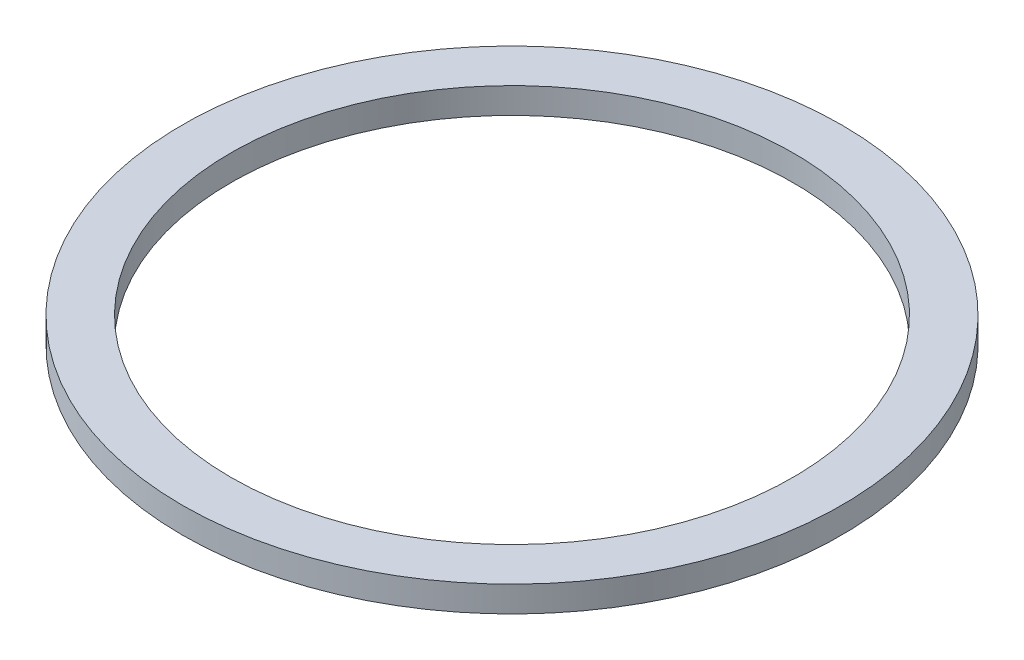
ISO-10303-21;
HEADER;
FILE_DESCRIPTION(('STEP AP214'),'2;1');
FILE_NAME('part.step','',(''),(''),'','','');
FILE_SCHEMA(('AUTOMOTIVE_DESIGN { 1 0 10303 214 1 1 1 1 }'));
ENDSEC;
DATA;
#1=APPLICATION_CONTEXT('core data for automotive mechanical design processes');
#2=APPLICATION_PROTOCOL_DEFINITION('international standard','automotive_design',2000,#1);
#3=PRODUCT_CONTEXT('',#1,'mechanical');
#4=PRODUCT('Part','Part','',(#3));
#5=PRODUCT_RELATED_PRODUCT_CATEGORY('part','',(#4));
#6=PRODUCT_DEFINITION_FORMATION('','',#4);
#7=PRODUCT_DEFINITION_CONTEXT('part definition',#1,'design');
#8=PRODUCT_DEFINITION('design','',#6,#7);
#9=PRODUCT_DEFINITION_SHAPE('','',#8);
#10=(LENGTH_UNIT() NAMED_UNIT(*) SI_UNIT(.MILLI.,.METRE.));
#11=(NAMED_UNIT(*) PLANE_ANGLE_UNIT() SI_UNIT($,.RADIAN.));
#12=(NAMED_UNIT(*) SI_UNIT($,.STERADIAN.) SOLID_ANGLE_UNIT());
#13=UNCERTAINTY_MEASURE_WITH_UNIT(LENGTH_MEASURE(1.E-05),#10,'distance_accuracy_value','');
#14=(GEOMETRIC_REPRESENTATION_CONTEXT(3) GLOBAL_UNCERTAINTY_ASSIGNED_CONTEXT((#13)) GLOBAL_UNIT_ASSIGNED_CONTEXT((#10,
#11,#12)) REPRESENTATION_CONTEXT('',''));
#15=CARTESIAN_POINT('',(0.,0.,0.));
#16=DIRECTION('',(0.,0.,1.));
#17=DIRECTION('',(1.,0.,0.));
#18=AXIS2_PLACEMENT_3D('',#15,#16,#17);
#19=CARTESIAN_POINT('',(0.,0.8,0.));
#20=DIRECTION('',(0.,1.,0.));
#21=DIRECTION('',(0.,0.,1.));
#22=AXIS2_PLACEMENT_3D('',#19,#20,#21);
#23=PLANE('',#22);
#24=CARTESIAN_POINT('',(0.,0.8,0.));
#25=DIRECTION('',(0.,1.,0.));
#26=DIRECTION('',(0.,0.,1.));
#27=AXIS2_PLACEMENT_3D('',#24,#25,#26);
#28=CIRCLE('',#27,10.2);
#29=CARTESIAN_POINT('',(0.,0.8,10.2));
#30=VERTEX_POINT('',#29);
#31=EDGE_CURVE('E10',#30,#30,#28,.T.);
#32=ORIENTED_EDGE('',*,*,#31,.T.);
#33=EDGE_LOOP('',(#32));
#34=FACE_BOUND('',#33,.T.);
#35=CARTESIAN_POINT('',(0.,0.8,0.));
#36=DIRECTION('',(0.,1.,0.));
#37=DIRECTION('',(0.,0.,1.));
#38=AXIS2_PLACEMENT_3D('',#35,#36,#37);
#39=CIRCLE('',#38,8.7);
#40=CARTESIAN_POINT('',(0.,0.8,8.7));
#41=VERTEX_POINT('',#40);
#42=EDGE_CURVE('E52',#41,#41,#39,.T.);
#43=ORIENTED_EDGE('',*,*,#42,.F.);
#44=EDGE_LOOP('',(#43));
#45=FACE_BOUND('',#44,.T.);
#46=ADVANCED_FACE('F39',(#34,#45),#23,.T.);
#47=CARTESIAN_POINT('',(0.,0.,0.));
#48=DIRECTION('',(0.,1.,0.));
#49=DIRECTION('',(0.,0.,1.));
#50=AXIS2_PLACEMENT_3D('',#47,#48,#49);
#51=PLANE('',#50);
#52=CARTESIAN_POINT('',(0.,0.,0.));
#53=DIRECTION('',(0.,1.,0.));
#54=DIRECTION('',(0.,0.,1.));
#55=AXIS2_PLACEMENT_3D('',#52,#53,#54);
#56=CIRCLE('',#55,10.2);
#57=CARTESIAN_POINT('',(0.,0.,10.2));
#58=VERTEX_POINT('',#57);
#59=EDGE_CURVE('E43',#58,#58,#56,.T.);
#60=ORIENTED_EDGE('',*,*,#59,.F.);
#61=EDGE_LOOP('',(#60));
#62=FACE_BOUND('',#61,.T.);
#63=CARTESIAN_POINT('',(0.,0.,0.));
#64=DIRECTION('',(0.,1.,0.));
#65=DIRECTION('',(0.,0.,1.));
#66=AXIS2_PLACEMENT_3D('',#63,#64,#65);
#67=CIRCLE('',#66,8.7);
#68=CARTESIAN_POINT('',(0.,0.,8.7));
#69=VERTEX_POINT('',#68);
#70=EDGE_CURVE('E54',#69,#69,#67,.T.);
#71=ORIENTED_EDGE('',*,*,#70,.T.);
#72=EDGE_LOOP('',(#71));
#73=FACE_BOUND('',#72,.T.);
#74=ADVANCED_FACE('F66',(#62,#73),#51,.F.);
#75=CARTESIAN_POINT('',(0.,0.8,0.));
#76=DIRECTION('',(0.,-1.,0.));
#77=DIRECTION('',(0.,0.,-1.));
#78=AXIS2_PLACEMENT_3D('',#75,#76,#77);
#79=CYLINDRICAL_SURFACE('',#78,10.2);
#80=ORIENTED_EDGE('',*,*,#31,.F.);
#81=EDGE_LOOP('',(#80));
#82=FACE_BOUND('',#81,.T.);
#83=ORIENTED_EDGE('',*,*,#59,.T.);
#84=EDGE_LOOP('',(#83));
#85=FACE_BOUND('',#84,.T.);
#86=ADVANCED_FACE('F41',(#82,#85),#79,.T.);
#87=CARTESIAN_POINT('',(0.,0.8,0.));
#88=DIRECTION('',(0.,-1.,0.));
#89=DIRECTION('',(0.,0.,-1.));
#90=AXIS2_PLACEMENT_3D('',#87,#88,#89);
#91=CYLINDRICAL_SURFACE('',#90,8.7);
#92=ORIENTED_EDGE('',*,*,#42,.T.);
#93=EDGE_LOOP('',(#92));
#94=FACE_BOUND('',#93,.T.);
#95=ORIENTED_EDGE('',*,*,#70,.F.);
#96=EDGE_LOOP('',(#95));
#97=FACE_BOUND('',#96,.T.);
#98=ADVANCED_FACE('F62',(#94,#97),#91,.F.);
#99=CLOSED_SHELL('',(#46,#74,#86,#98));
#100=MANIFOLD_SOLID_BREP('B2',#99);
#101=ADVANCED_BREP_SHAPE_REPRESENTATION('',(#18,#100),#14);
#102=SHAPE_DEFINITION_REPRESENTATION(#9,#101);
ENDSEC;
END-ISO-10303-21;
